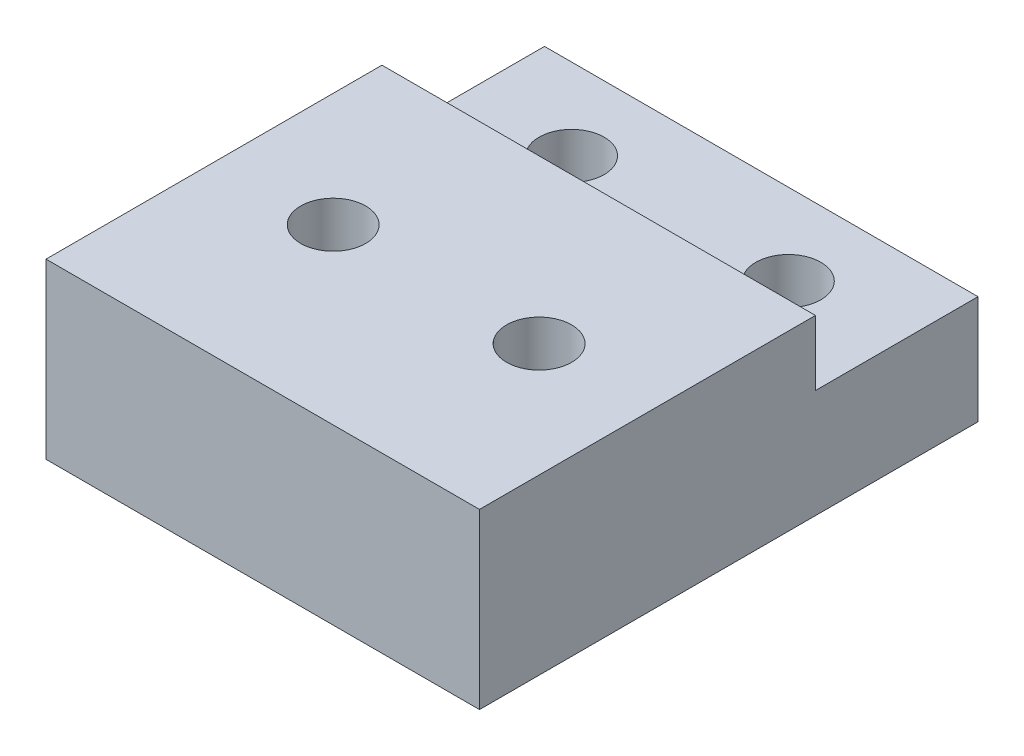
ISO-10303-21;
HEADER;
FILE_DESCRIPTION(('STEP AP214'),'2;1');
FILE_NAME('part.step','',(''),(''),'','','');
FILE_SCHEMA(('AUTOMOTIVE_DESIGN { 1 0 10303 214 1 1 1 1 }'));
ENDSEC;
DATA;
#1=APPLICATION_CONTEXT('core data for automotive mechanical design processes');
#2=APPLICATION_PROTOCOL_DEFINITION('international standard','automotive_design',2000,#1);
#3=PRODUCT_CONTEXT('',#1,'mechanical');
#4=PRODUCT('Part','Part','',(#3));
#5=PRODUCT_RELATED_PRODUCT_CATEGORY('part','',(#4));
#6=PRODUCT_DEFINITION_FORMATION('','',#4);
#7=PRODUCT_DEFINITION_CONTEXT('part definition',#1,'design');
#8=PRODUCT_DEFINITION('design','',#6,#7);
#9=PRODUCT_DEFINITION_SHAPE('','',#8);
#10=(LENGTH_UNIT() NAMED_UNIT(*) SI_UNIT(.MILLI.,.METRE.));
#11=(NAMED_UNIT(*) PLANE_ANGLE_UNIT() SI_UNIT($,.RADIAN.));
#12=(NAMED_UNIT(*) SI_UNIT($,.STERADIAN.) SOLID_ANGLE_UNIT());
#13=UNCERTAINTY_MEASURE_WITH_UNIT(LENGTH_MEASURE(1.E-05),#10,'distance_accuracy_value','');
#14=(GEOMETRIC_REPRESENTATION_CONTEXT(3) GLOBAL_UNCERTAINTY_ASSIGNED_CONTEXT((#13)) GLOBAL_UNIT_ASSIGNED_CONTEXT((#10,
#11,#12)) REPRESENTATION_CONTEXT('',''));
#15=CARTESIAN_POINT('',(0.,0.,0.));
#16=DIRECTION('',(0.,0.,1.));
#17=DIRECTION('',(1.,0.,0.));
#18=AXIS2_PLACEMENT_3D('',#15,#16,#17);
#19=CARTESIAN_POINT('',(0.,8.,-5.));
#20=DIRECTION('',(0.,0.,-1.));
#21=DIRECTION('',(-1.,0.,0.));
#22=AXIS2_PLACEMENT_3D('',#19,#20,#21);
#23=PLANE('',#22);
#24=DIRECTION('',(1.,0.,0.));
#25=VECTOR('',#24,1.);
#26=CARTESIAN_POINT('',(0.,5.,-5.));
#27=LINE('',#26,#25);
#28=CARTESIAN_POINT('',(-10.,5.,-5.));
#29=VERTEX_POINT('',#28);
#30=CARTESIAN_POINT('',(10.,5.,-5.));
#31=VERTEX_POINT('',#30);
#32=EDGE_CURVE('E56',#29,#31,#27,.T.);
#33=ORIENTED_EDGE('',*,*,#32,.F.);
#34=DIRECTION('',(0.,-1.,0.));
#35=VECTOR('',#34,1.);
#36=CARTESIAN_POINT('',(-10.,8.,-5.));
#37=LINE('',#36,#35);
#38=CARTESIAN_POINT('',(-10.,8.,-5.));
#39=VERTEX_POINT('',#38);
#40=EDGE_CURVE('E42',#39,#29,#37,.T.);
#41=ORIENTED_EDGE('',*,*,#40,.F.);
#42=DIRECTION('',(1.,0.,0.));
#43=VECTOR('',#42,1.);
#44=CARTESIAN_POINT('',(0.,8.,-5.));
#45=LINE('',#44,#43);
#46=CARTESIAN_POINT('',(10.,8.,-5.));
#47=VERTEX_POINT('',#46);
#48=EDGE_CURVE('E108',#39,#47,#45,.T.);
#49=ORIENTED_EDGE('',*,*,#48,.T.);
#50=DIRECTION('',(0.,-1.,0.));
#51=VECTOR('',#50,1.);
#52=CARTESIAN_POINT('',(10.,8.,-5.));
#53=LINE('',#52,#51);
#54=EDGE_CURVE('E104',#47,#31,#53,.T.);
#55=ORIENTED_EDGE('',*,*,#54,.T.);
#56=EDGE_LOOP('',(#33,#41,#49,#55));
#57=FACE_BOUND('',#56,.T.);
#58=ADVANCED_FACE('F35',(#57),#23,.T.);
#59=CARTESIAN_POINT('',(-10.,8.,0.));
#60=DIRECTION('',(-1.,0.,0.));
#61=DIRECTION('',(0.,0.,1.));
#62=AXIS2_PLACEMENT_3D('',#59,#60,#61);
#63=PLANE('',#62);
#64=DIRECTION('',(0.,1.,0.));
#65=VECTOR('',#64,1.);
#66=CARTESIAN_POINT('',(-10.,-27.,10.5));
#67=LINE('',#66,#65);
#68=CARTESIAN_POINT('',(-10.,0.,10.5));
#69=VERTEX_POINT('',#68);
#70=CARTESIAN_POINT('',(-10.,8.,10.5));
#71=VERTEX_POINT('',#70);
#72=EDGE_CURVE('E49',#69,#71,#67,.T.);
#73=ORIENTED_EDGE('',*,*,#72,.T.);
#74=DIRECTION('',(0.,0.,-1.));
#75=VECTOR('',#74,1.);
#76=CARTESIAN_POINT('',(-10.,8.,0.));
#77=LINE('',#76,#75);
#78=EDGE_CURVE('E100',#71,#39,#77,.T.);
#79=ORIENTED_EDGE('',*,*,#78,.T.);
#80=ORIENTED_EDGE('',*,*,#40,.T.);
#81=DIRECTION('',(0.,0.,-1.));
#82=VECTOR('',#81,1.);
#83=CARTESIAN_POINT('',(-10.,5.,0.));
#84=LINE('',#83,#82);
#85=CARTESIAN_POINT('',(-10.,5.,-12.5));
#86=VERTEX_POINT('',#85);
#87=EDGE_CURVE('E136',#29,#86,#84,.T.);
#88=ORIENTED_EDGE('',*,*,#87,.T.);
#89=DIRECTION('',(0.,-1.,0.));
#90=VECTOR('',#89,1.);
#91=CARTESIAN_POINT('',(-10.,5.,-12.5));
#92=LINE('',#91,#90);
#93=CARTESIAN_POINT('',(-10.,0.,-12.5));
#94=VERTEX_POINT('',#93);
#95=EDGE_CURVE('E145',#86,#94,#92,.T.);
#96=ORIENTED_EDGE('',*,*,#95,.T.);
#97=DIRECTION('',(0.,0.,-1.));
#98=VECTOR('',#97,1.);
#99=CARTESIAN_POINT('',(-10.,0.,0.));
#100=LINE('',#99,#98);
#101=EDGE_CURVE('E112',#69,#94,#100,.T.);
#102=ORIENTED_EDGE('',*,*,#101,.F.);
#103=EDGE_LOOP('',(#73,#79,#80,#88,#96,#102));
#104=FACE_BOUND('',#103,.T.);
#105=ADVANCED_FACE('F154',(#104),#63,.T.);
#106=CARTESIAN_POINT('',(10.,8.,0.));
#107=DIRECTION('',(-1.,0.,0.));
#108=DIRECTION('',(0.,0.,1.));
#109=AXIS2_PLACEMENT_3D('',#106,#107,#108);
#110=PLANE('',#109);
#111=DIRECTION('',(0.,0.,-1.));
#112=VECTOR('',#111,1.);
#113=CARTESIAN_POINT('',(10.,8.,0.));
#114=LINE('',#113,#112);
#115=CARTESIAN_POINT('',(10.,8.,10.5));
#116=VERTEX_POINT('',#115);
#117=EDGE_CURVE('E98',#116,#47,#114,.T.);
#118=ORIENTED_EDGE('',*,*,#117,.F.);
#119=DIRECTION('',(0.,1.,0.));
#120=VECTOR('',#119,1.);
#121=CARTESIAN_POINT('',(10.,-27.,10.5));
#122=LINE('',#121,#120);
#123=CARTESIAN_POINT('',(10.,0.,10.5));
#124=VERTEX_POINT('',#123);
#125=EDGE_CURVE('E85',#124,#116,#122,.T.);
#126=ORIENTED_EDGE('',*,*,#125,.F.);
#127=DIRECTION('',(0.,0.,-1.));
#128=VECTOR('',#127,1.);
#129=CARTESIAN_POINT('',(10.,0.,0.));
#130=LINE('',#129,#128);
#131=CARTESIAN_POINT('',(10.,0.,-12.5));
#132=VERTEX_POINT('',#131);
#133=EDGE_CURVE('E114',#124,#132,#130,.T.);
#134=ORIENTED_EDGE('',*,*,#133,.T.);
#135=DIRECTION('',(0.,-1.,0.));
#136=VECTOR('',#135,1.);
#137=CARTESIAN_POINT('',(10.,5.,-12.5));
#138=LINE('',#137,#136);
#139=CARTESIAN_POINT('',(10.,5.,-12.5));
#140=VERTEX_POINT('',#139);
#141=EDGE_CURVE('E115',#140,#132,#138,.T.);
#142=ORIENTED_EDGE('',*,*,#141,.F.);
#143=DIRECTION('',(0.,0.,-1.));
#144=VECTOR('',#143,1.);
#145=CARTESIAN_POINT('',(10.,5.,0.));
#146=LINE('',#145,#144);
#147=EDGE_CURVE('E141',#31,#140,#146,.T.);
#148=ORIENTED_EDGE('',*,*,#147,.F.);
#149=ORIENTED_EDGE('',*,*,#54,.F.);
#150=EDGE_LOOP('',(#118,#126,#134,#142,#148,#149));
#151=FACE_BOUND('',#150,.T.);
#152=ADVANCED_FACE('F102',(#151),#110,.F.);
#153=CARTESIAN_POINT('',(0.,8.,0.));
#154=DIRECTION('',(0.,1.,0.));
#155=DIRECTION('',(0.,0.,1.));
#156=AXIS2_PLACEMENT_3D('',#153,#154,#155);
#157=PLANE('',#156);
#158=DIRECTION('',(-1.,0.,0.));
#159=VECTOR('',#158,1.);
#160=CARTESIAN_POINT('',(0.,8.,10.5));
#161=LINE('',#160,#159);
#162=EDGE_CURVE('E88',#116,#71,#161,.T.);
#163=ORIENTED_EDGE('',*,*,#162,.F.);
#164=ORIENTED_EDGE('',*,*,#117,.T.);
#165=ORIENTED_EDGE('',*,*,#48,.F.);
#166=ORIENTED_EDGE('',*,*,#78,.F.);
#167=EDGE_LOOP('',(#163,#164,#165,#166));
#168=FACE_BOUND('',#167,.T.);
#169=CARTESIAN_POINT('',(-4.75,8.,2.49999999999999));
#170=DIRECTION('',(0.,1.,0.));
#171=DIRECTION('',(0.,0.,1.));
#172=AXIS2_PLACEMENT_3D('',#169,#170,#171);
#173=CIRCLE('',#172,1.5);
#174=CARTESIAN_POINT('',(-4.75,8.,3.99999999999999));
#175=VERTEX_POINT('',#174);
#176=EDGE_CURVE('E121',#175,#175,#173,.T.);
#177=ORIENTED_EDGE('',*,*,#176,.F.);
#178=EDGE_LOOP('',(#177));
#179=FACE_BOUND('',#178,.T.);
#180=CARTESIAN_POINT('',(4.75,8.,2.49999999999999));
#181=DIRECTION('',(0.,1.,0.));
#182=DIRECTION('',(0.,0.,1.));
#183=AXIS2_PLACEMENT_3D('',#180,#181,#182);
#184=CIRCLE('',#183,1.5);
#185=CARTESIAN_POINT('',(4.75,8.,3.99999999999999));
#186=VERTEX_POINT('',#185);
#187=EDGE_CURVE('E286',#186,#186,#184,.T.);
#188=ORIENTED_EDGE('',*,*,#187,.F.);
#189=EDGE_LOOP('',(#188));
#190=FACE_BOUND('',#189,.T.);
#191=ADVANCED_FACE('F95',(#168,#179,#190),#157,.T.);
#192=CARTESIAN_POINT('',(0.,0.,0.));
#193=DIRECTION('',(0.,1.,0.));
#194=DIRECTION('',(0.,0.,1.));
#195=AXIS2_PLACEMENT_3D('',#192,#193,#194);
#196=PLANE('',#195);
#197=CARTESIAN_POINT('',(-4.75,0.,2.49999999999999));
#198=DIRECTION('',(0.,1.,0.));
#199=DIRECTION('',(0.,0.,1.));
#200=AXIS2_PLACEMENT_3D('',#197,#198,#199);
#201=CIRCLE('',#200,1.5);
#202=CARTESIAN_POINT('',(-4.75,0.,3.99999999999999));
#203=VERTEX_POINT('',#202);
#204=EDGE_CURVE('E120',#203,#203,#201,.T.);
#205=ORIENTED_EDGE('',*,*,#204,.T.);
#206=EDGE_LOOP('',(#205));
#207=FACE_BOUND('',#206,.T.);
#208=CARTESIAN_POINT('',(4.75,0.,2.49999999999999));
#209=DIRECTION('',(0.,1.,0.));
#210=DIRECTION('',(0.,0.,1.));
#211=AXIS2_PLACEMENT_3D('',#208,#209,#210);
#212=CIRCLE('',#211,1.5);
#213=CARTESIAN_POINT('',(4.75,0.,3.99999999999999));
#214=VERTEX_POINT('',#213);
#215=EDGE_CURVE('E118',#214,#214,#212,.T.);
#216=ORIENTED_EDGE('',*,*,#215,.T.);
#217=EDGE_LOOP('',(#216));
#218=FACE_BOUND('',#217,.T.);
#219=CARTESIAN_POINT('',(-5.,0.,-8.75));
#220=DIRECTION('',(0.,1.,0.));
#221=DIRECTION('',(0.,0.,1.));
#222=AXIS2_PLACEMENT_3D('',#219,#220,#221);
#223=CIRCLE('',#222,1.5);
#224=CARTESIAN_POINT('',(-5.,0.,-7.25));
#225=VERTEX_POINT('',#224);
#226=EDGE_CURVE('E148',#225,#225,#223,.T.);
#227=ORIENTED_EDGE('',*,*,#226,.T.);
#228=EDGE_LOOP('',(#227));
#229=FACE_BOUND('',#228,.T.);
#230=CARTESIAN_POINT('',(5.,0.,-8.75));
#231=DIRECTION('',(0.,1.,0.));
#232=DIRECTION('',(0.,0.,1.));
#233=AXIS2_PLACEMENT_3D('',#230,#231,#232);
#234=CIRCLE('',#233,1.5);
#235=CARTESIAN_POINT('',(5.,0.,-7.25));
#236=VERTEX_POINT('',#235);
#237=EDGE_CURVE('E127',#236,#236,#234,.T.);
#238=ORIENTED_EDGE('',*,*,#237,.T.);
#239=EDGE_LOOP('',(#238));
#240=FACE_BOUND('',#239,.T.);
#241=ORIENTED_EDGE('',*,*,#133,.F.);
#242=DIRECTION('',(-1.,0.,0.));
#243=VECTOR('',#242,1.);
#244=CARTESIAN_POINT('',(0.,0.,10.5));
#245=LINE('',#244,#243);
#246=EDGE_CURVE('E11',#124,#69,#245,.T.);
#247=ORIENTED_EDGE('',*,*,#246,.T.);
#248=ORIENTED_EDGE('',*,*,#101,.T.);
#249=DIRECTION('',(-1.,0.,0.));
#250=VECTOR('',#249,1.);
#251=CARTESIAN_POINT('',(0.,0.,-12.5));
#252=LINE('',#251,#250);
#253=EDGE_CURVE('E139',#132,#94,#252,.T.);
#254=ORIENTED_EDGE('',*,*,#253,.F.);
#255=EDGE_LOOP('',(#241,#247,#248,#254));
#256=FACE_BOUND('',#255,.T.);
#257=ADVANCED_FACE('F165',(#207,#218,#229,#240,#256),#196,.F.);
#258=CARTESIAN_POINT('',(0.,5.,-12.5));
#259=DIRECTION('',(0.,0.,1.));
#260=DIRECTION('',(1.,0.,0.));
#261=AXIS2_PLACEMENT_3D('',#258,#259,#260);
#262=PLANE('',#261);
#263=ORIENTED_EDGE('',*,*,#253,.T.);
#264=ORIENTED_EDGE('',*,*,#95,.F.);
#265=DIRECTION('',(-1.,0.,0.));
#266=VECTOR('',#265,1.);
#267=CARTESIAN_POINT('',(0.,5.,-12.5));
#268=LINE('',#267,#266);
#269=EDGE_CURVE('E143',#140,#86,#268,.T.);
#270=ORIENTED_EDGE('',*,*,#269,.F.);
#271=ORIENTED_EDGE('',*,*,#141,.T.);
#272=EDGE_LOOP('',(#263,#264,#270,#271));
#273=FACE_BOUND('',#272,.T.);
#274=ADVANCED_FACE('F161',(#273),#262,.F.);
#275=CARTESIAN_POINT('',(0.,5.,0.));
#276=DIRECTION('',(0.,1.,0.));
#277=DIRECTION('',(0.,0.,1.));
#278=AXIS2_PLACEMENT_3D('',#275,#276,#277);
#279=PLANE('',#278);
#280=CARTESIAN_POINT('',(-5.,5.,-8.75));
#281=DIRECTION('',(0.,1.,0.));
#282=DIRECTION('',(0.,0.,1.));
#283=AXIS2_PLACEMENT_3D('',#280,#281,#282);
#284=CIRCLE('',#283,1.5);
#285=CARTESIAN_POINT('',(-5.,5.,-7.25));
#286=VERTEX_POINT('',#285);
#287=EDGE_CURVE('E132',#286,#286,#284,.T.);
#288=ORIENTED_EDGE('',*,*,#287,.F.);
#289=EDGE_LOOP('',(#288));
#290=FACE_BOUND('',#289,.T.);
#291=CARTESIAN_POINT('',(5.,5.,-8.75));
#292=DIRECTION('',(0.,1.,0.));
#293=DIRECTION('',(0.,0.,1.));
#294=AXIS2_PLACEMENT_3D('',#291,#292,#293);
#295=CIRCLE('',#294,1.5);
#296=CARTESIAN_POINT('',(5.,5.,-7.25));
#297=VERTEX_POINT('',#296);
#298=EDGE_CURVE('E123',#297,#297,#295,.T.);
#299=ORIENTED_EDGE('',*,*,#298,.F.);
#300=EDGE_LOOP('',(#299));
#301=FACE_BOUND('',#300,.T.);
#302=ORIENTED_EDGE('',*,*,#87,.F.);
#303=ORIENTED_EDGE('',*,*,#32,.T.);
#304=ORIENTED_EDGE('',*,*,#147,.T.);
#305=ORIENTED_EDGE('',*,*,#269,.T.);
#306=EDGE_LOOP('',(#302,#303,#304,#305));
#307=FACE_BOUND('',#306,.T.);
#308=ADVANCED_FACE('F156',(#290,#301,#307),#279,.T.);
#309=CARTESIAN_POINT('',(5.,0.,-8.75));
#310=DIRECTION('',(0.,1.,0.));
#311=DIRECTION('',(0.,0.,1.));
#312=AXIS2_PLACEMENT_3D('',#309,#310,#311);
#313=CYLINDRICAL_SURFACE('',#312,1.5);
#314=ORIENTED_EDGE('',*,*,#237,.F.);
#315=EDGE_LOOP('',(#314));
#316=FACE_BOUND('',#315,.T.);
#317=ORIENTED_EDGE('',*,*,#298,.T.);
#318=EDGE_LOOP('',(#317));
#319=FACE_BOUND('',#318,.T.);
#320=ADVANCED_FACE('F229',(#316,#319),#313,.F.);
#321=CARTESIAN_POINT('',(-5.,0.,-8.75));
#322=DIRECTION('',(0.,1.,0.));
#323=DIRECTION('',(0.,0.,1.));
#324=AXIS2_PLACEMENT_3D('',#321,#322,#323);
#325=CYLINDRICAL_SURFACE('',#324,1.5);
#326=ORIENTED_EDGE('',*,*,#226,.F.);
#327=EDGE_LOOP('',(#326));
#328=FACE_BOUND('',#327,.T.);
#329=ORIENTED_EDGE('',*,*,#287,.T.);
#330=EDGE_LOOP('',(#329));
#331=FACE_BOUND('',#330,.T.);
#332=ADVANCED_FACE('F221',(#328,#331),#325,.F.);
#333=CARTESIAN_POINT('',(4.75,-12.,2.49999999999999));
#334=DIRECTION('',(0.,1.,0.));
#335=DIRECTION('',(0.,0.,1.));
#336=AXIS2_PLACEMENT_3D('',#333,#334,#335);
#337=CYLINDRICAL_SURFACE('',#336,1.5);
#338=ORIENTED_EDGE('',*,*,#187,.T.);
#339=EDGE_LOOP('',(#338));
#340=FACE_BOUND('',#339,.T.);
#341=ORIENTED_EDGE('',*,*,#215,.F.);
#342=EDGE_LOOP('',(#341));
#343=FACE_BOUND('',#342,.T.);
#344=ADVANCED_FACE('F214',(#340,#343),#337,.F.);
#345=CARTESIAN_POINT('',(-4.75,-12.,2.49999999999999));
#346=DIRECTION('',(0.,1.,0.));
#347=DIRECTION('',(0.,0.,1.));
#348=AXIS2_PLACEMENT_3D('',#345,#346,#347);
#349=CYLINDRICAL_SURFACE('',#348,1.5);
#350=ORIENTED_EDGE('',*,*,#176,.T.);
#351=EDGE_LOOP('',(#350));
#352=FACE_BOUND('',#351,.T.);
#353=ORIENTED_EDGE('',*,*,#204,.F.);
#354=EDGE_LOOP('',(#353));
#355=FACE_BOUND('',#354,.T.);
#356=ADVANCED_FACE('F204',(#352,#355),#349,.F.);
#357=CARTESIAN_POINT('',(0.,-27.,10.5));
#358=DIRECTION('',(0.,0.,-1.));
#359=DIRECTION('',(-1.,0.,0.));
#360=AXIS2_PLACEMENT_3D('',#357,#358,#359);
#361=PLANE('',#360);
#362=ORIENTED_EDGE('',*,*,#125,.T.);
#363=ORIENTED_EDGE('',*,*,#162,.T.);
#364=ORIENTED_EDGE('',*,*,#72,.F.);
#365=ORIENTED_EDGE('',*,*,#246,.F.);
#366=EDGE_LOOP('',(#362,#363,#364,#365));
#367=FACE_BOUND('',#366,.T.);
#368=ADVANCED_FACE('F87',(#367),#361,.F.);
#369=CLOSED_SHELL('',(#58,#105,#152,#191,#257,#274,#308,#320,#332,#344,#356,#368));
#370=MANIFOLD_SOLID_BREP('B2',#369);
#371=ADVANCED_BREP_SHAPE_REPRESENTATION('',(#18,#370),#14);
#372=SHAPE_DEFINITION_REPRESENTATION(#9,#371);
ENDSEC;
END-ISO-10303-21;
